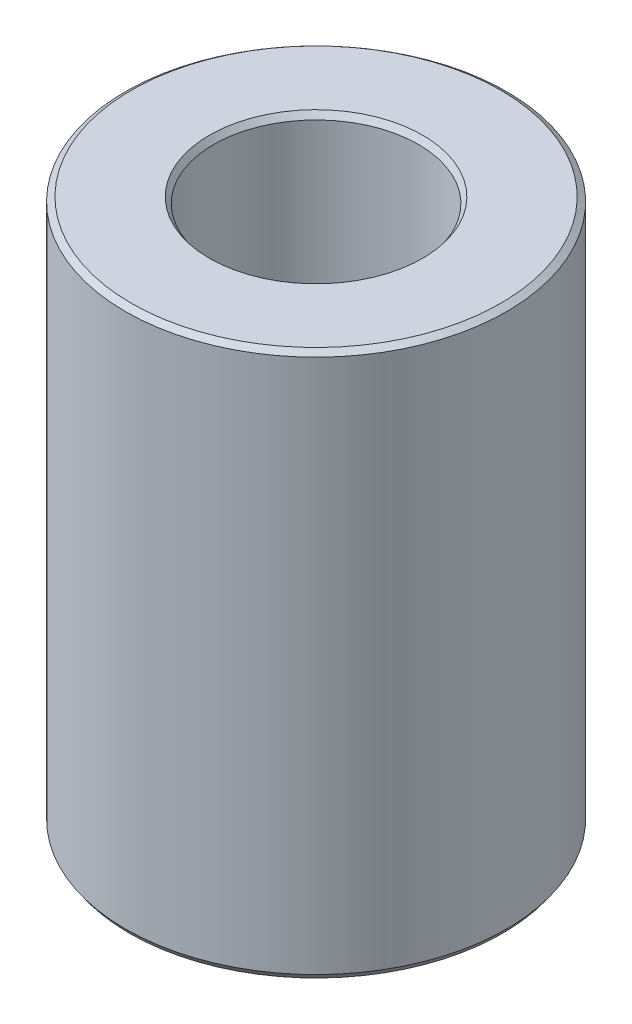
ISO-10303-21;
HEADER;
FILE_DESCRIPTION(('STEP AP214'),'2;1');
FILE_NAME('part.step','',(''),(''),'','','');
FILE_SCHEMA(('AUTOMOTIVE_DESIGN { 1 0 10303 214 1 1 1 1 }'));
ENDSEC;
DATA;
#1=APPLICATION_CONTEXT('core data for automotive mechanical design processes');
#2=APPLICATION_PROTOCOL_DEFINITION('international standard','automotive_design',2000,#1);
#3=PRODUCT_CONTEXT('',#1,'mechanical');
#4=PRODUCT('Part','Part','',(#3));
#5=PRODUCT_RELATED_PRODUCT_CATEGORY('part','',(#4));
#6=PRODUCT_DEFINITION_FORMATION('','',#4);
#7=PRODUCT_DEFINITION_CONTEXT('part definition',#1,'design');
#8=PRODUCT_DEFINITION('design','',#6,#7);
#9=PRODUCT_DEFINITION_SHAPE('','',#8);
#10=(LENGTH_UNIT() NAMED_UNIT(*) SI_UNIT(.MILLI.,.METRE.));
#11=(NAMED_UNIT(*) PLANE_ANGLE_UNIT() SI_UNIT($,.RADIAN.));
#12=(NAMED_UNIT(*) SI_UNIT($,.STERADIAN.) SOLID_ANGLE_UNIT());
#13=UNCERTAINTY_MEASURE_WITH_UNIT(LENGTH_MEASURE(1.E-05),#10,'distance_accuracy_value','');
#14=(GEOMETRIC_REPRESENTATION_CONTEXT(3) GLOBAL_UNCERTAINTY_ASSIGNED_CONTEXT((#13)) GLOBAL_UNIT_ASSIGNED_CONTEXT((#10,
#11,#12)) REPRESENTATION_CONTEXT('',''));
#15=CARTESIAN_POINT('',(0.,0.,0.));
#16=DIRECTION('',(0.,0.,1.));
#17=DIRECTION('',(1.,0.,0.));
#18=AXIS2_PLACEMENT_3D('',#15,#16,#17);
#19=CARTESIAN_POINT('',(0.,71.466312187616,0.));
#20=DIRECTION('',(0.,-1.,0.));
#21=DIRECTION('',(0.,0.,-1.));
#22=AXIS2_PLACEMENT_3D('',#19,#20,#21);
#23=CYLINDRICAL_SURFACE('',#22,25.);
#24=CARTESIAN_POINT('',(0.,0.779476207034169,0.));
#25=DIRECTION('',(0.,1.,0.));
#26=DIRECTION('',(0.,0.,1.));
#27=AXIS2_PLACEMENT_3D('',#24,#25,#26);
#28=CIRCLE('',#27,25.);
#29=CARTESIAN_POINT('',(0.,0.779476207034169,25.));
#30=VERTEX_POINT('',#29);
#31=EDGE_CURVE('E10',#30,#30,#28,.T.);
#32=ORIENTED_EDGE('',*,*,#31,.T.);
#33=EDGE_LOOP('',(#32));
#34=FACE_BOUND('',#33,.T.);
#35=CARTESIAN_POINT('',(0.,70.9158581703228,0.));
#36=DIRECTION('',(0.,1.,0.));
#37=DIRECTION('',(0.,0.,1.));
#38=AXIS2_PLACEMENT_3D('',#35,#36,#37);
#39=CIRCLE('',#38,25.);
#40=CARTESIAN_POINT('',(0.,70.9158581703228,25.));
#41=VERTEX_POINT('',#40);
#42=EDGE_CURVE('E50',#41,#41,#39,.F.);
#43=ORIENTED_EDGE('',*,*,#42,.T.);
#44=EDGE_LOOP('',(#43));
#45=FACE_BOUND('',#44,.T.);
#46=ADVANCED_FACE('F39',(#34,#45),#23,.T.);
#47=CARTESIAN_POINT('',(0.,71.466312187616,0.));
#48=DIRECTION('',(0.,1.,0.));
#49=DIRECTION('',(0.,0.,1.));
#50=AXIS2_PLACEMENT_3D('',#47,#48,#49);
#51=PLANE('',#50);
#52=CARTESIAN_POINT('',(0.,71.466312187616,0.));
#53=DIRECTION('',(0.,1.,0.));
#54=DIRECTION('',(0.,0.,1.));
#55=AXIS2_PLACEMENT_3D('',#52,#53,#54);
#56=CIRCLE('',#55,13.9906235481903);
#57=CARTESIAN_POINT('',(0.,71.466312187616,13.9906235481903));
#58=VERTEX_POINT('',#57);
#59=EDGE_CURVE('E58',#58,#58,#56,.F.);
#60=ORIENTED_EDGE('',*,*,#59,.T.);
#61=EDGE_LOOP('',(#60));
#62=FACE_BOUND('',#61,.T.);
#63=CARTESIAN_POINT('',(0.,71.466312187616,0.));
#64=DIRECTION('',(0.,1.,0.));
#65=DIRECTION('',(0.,0.,1.));
#66=AXIS2_PLACEMENT_3D('',#63,#64,#65);
#67=CIRCLE('',#66,24.2205237929659);
#68=CARTESIAN_POINT('',(0.,71.466312187616,24.2205237929659));
#69=VERTEX_POINT('',#68);
#70=EDGE_CURVE('E61',#69,#69,#67,.T.);
#71=ORIENTED_EDGE('',*,*,#70,.T.);
#72=EDGE_LOOP('',(#71));
#73=FACE_BOUND('',#72,.T.);
#74=ADVANCED_FACE('F88',(#62,#73),#51,.T.);
#75=CARTESIAN_POINT('',(0.,0.,0.));
#76=DIRECTION('',(0.,1.,0.));
#77=DIRECTION('',(0.,0.,1.));
#78=AXIS2_PLACEMENT_3D('',#75,#76,#77);
#79=PLANE('',#78);
#80=CARTESIAN_POINT('',(0.,0.,0.));
#81=DIRECTION('',(0.,1.,0.));
#82=DIRECTION('',(0.,0.,1.));
#83=AXIS2_PLACEMENT_3D('',#80,#81,#82);
#84=CIRCLE('',#83,14.2196457379313);
#85=CARTESIAN_POINT('',(0.,0.,14.2196457379313));
#86=VERTEX_POINT('',#85);
#87=EDGE_CURVE('E51',#86,#86,#84,.T.);
#88=ORIENTED_EDGE('',*,*,#87,.T.);
#89=EDGE_LOOP('',(#88));
#90=FACE_BOUND('',#89,.T.);
#91=CARTESIAN_POINT('',(0.,0.,0.));
#92=DIRECTION('',(0.,1.,0.));
#93=DIRECTION('',(0.,0.,1.));
#94=AXIS2_PLACEMENT_3D('',#91,#92,#93);
#95=CIRCLE('',#94,24.4495459827068);
#96=CARTESIAN_POINT('',(0.,0.,24.4495459827068));
#97=VERTEX_POINT('',#96);
#98=EDGE_CURVE('E54',#97,#97,#95,.F.);
#99=ORIENTED_EDGE('',*,*,#98,.T.);
#100=EDGE_LOOP('',(#99));
#101=FACE_BOUND('',#100,.T.);
#102=ADVANCED_FACE('F83',(#90,#101),#79,.F.);
#103=CARTESIAN_POINT('',(0.,71.466312187616,0.));
#104=DIRECTION('',(0.,-1.,0.));
#105=DIRECTION('',(0.,0.,-1.));
#106=AXIS2_PLACEMENT_3D('',#103,#104,#105);
#107=CYLINDRICAL_SURFACE('',#106,13.4401695308971);
#108=CARTESIAN_POINT('',(0.,70.6868359805818,0.));
#109=DIRECTION('',(0.,1.,0.));
#110=DIRECTION('',(0.,0.,1.));
#111=AXIS2_PLACEMENT_3D('',#108,#109,#110);
#112=CIRCLE('',#111,13.4401695308971);
#113=CARTESIAN_POINT('',(0.,70.6868359805818,13.4401695308971));
#114=VERTEX_POINT('',#113);
#115=EDGE_CURVE('E67',#114,#114,#112,.T.);
#116=ORIENTED_EDGE('',*,*,#115,.T.);
#117=EDGE_LOOP('',(#116));
#118=FACE_BOUND('',#117,.T.);
#119=CARTESIAN_POINT('',(0.,0.550454017293159,0.));
#120=DIRECTION('',(0.,1.,0.));
#121=DIRECTION('',(0.,0.,1.));
#122=AXIS2_PLACEMENT_3D('',#119,#120,#121);
#123=CIRCLE('',#122,13.4401695308971);
#124=CARTESIAN_POINT('',(0.,0.550454017293159,13.4401695308971));
#125=VERTEX_POINT('',#124);
#126=EDGE_CURVE('E69',#125,#125,#123,.F.);
#127=ORIENTED_EDGE('',*,*,#126,.T.);
#128=EDGE_LOOP('',(#127));
#129=FACE_BOUND('',#128,.T.);
#130=ADVANCED_FACE('F71',(#118,#129),#107,.F.);
#131=CARTESIAN_POINT('',(0.,70.6868359805818,0.));
#132=DIRECTION('',(0.,1.,0.));
#133=DIRECTION('',(0.,0.,1.));
#134=AXIS2_PLACEMENT_3D('',#131,#132,#133);
#135=CONICAL_SURFACE('',#134,13.4401695308971,0.614864588701181);
#136=ORIENTED_EDGE('',*,*,#59,.F.);
#137=EDGE_LOOP('',(#136));
#138=FACE_BOUND('',#137,.T.);
#139=ORIENTED_EDGE('',*,*,#115,.F.);
#140=EDGE_LOOP('',(#139));
#141=FACE_BOUND('',#140,.T.);
#142=ADVANCED_FACE('F77',(#138,#141),#135,.F.);
#143=CARTESIAN_POINT('',(0.,0.,0.));
#144=DIRECTION('',(0.,-1.,0.));
#145=DIRECTION('',(0.,0.,-1.));
#146=AXIS2_PLACEMENT_3D('',#143,#144,#145);
#147=CONICAL_SURFACE('',#146,14.2196457379313,0.955931738093711);
#148=ORIENTED_EDGE('',*,*,#126,.F.);
#149=EDGE_LOOP('',(#148));
#150=FACE_BOUND('',#149,.T.);
#151=ORIENTED_EDGE('',*,*,#87,.F.);
#152=EDGE_LOOP('',(#151));
#153=FACE_BOUND('',#152,.T.);
#154=ADVANCED_FACE('F73',(#150,#153),#147,.F.);
#155=CARTESIAN_POINT('',(0.,0.779476207034169,0.));
#156=DIRECTION('',(0.,1.,0.));
#157=DIRECTION('',(0.,0.,1.));
#158=AXIS2_PLACEMENT_3D('',#155,#156,#157);
#159=CONICAL_SURFACE('',#158,25.,0.614864588701176);
#160=ORIENTED_EDGE('',*,*,#98,.F.);
#161=EDGE_LOOP('',(#160));
#162=FACE_BOUND('',#161,.T.);
#163=ORIENTED_EDGE('',*,*,#31,.F.);
#164=EDGE_LOOP('',(#163));
#165=FACE_BOUND('',#164,.T.);
#166=ADVANCED_FACE('F76',(#162,#165),#159,.T.);
#167=CARTESIAN_POINT('',(0.,71.466312187616,0.));
#168=DIRECTION('',(0.,-1.,0.));
#169=DIRECTION('',(0.,0.,-1.));
#170=AXIS2_PLACEMENT_3D('',#167,#168,#169);
#171=CONICAL_SURFACE('',#170,24.2205237929659,0.955931738093708);
#172=ORIENTED_EDGE('',*,*,#42,.F.);
#173=EDGE_LOOP('',(#172));
#174=FACE_BOUND('',#173,.T.);
#175=ORIENTED_EDGE('',*,*,#70,.F.);
#176=EDGE_LOOP('',(#175));
#177=FACE_BOUND('',#176,.T.);
#178=ADVANCED_FACE('F45',(#174,#177),#171,.T.);
#179=CLOSED_SHELL('',(#46,#74,#102,#130,#142,#154,#166,#178));
#180=MANIFOLD_SOLID_BREP('B2',#179);
#181=ADVANCED_BREP_SHAPE_REPRESENTATION('',(#18,#180),#14);
#182=SHAPE_DEFINITION_REPRESENTATION(#9,#181);
ENDSEC;
END-ISO-10303-21;
